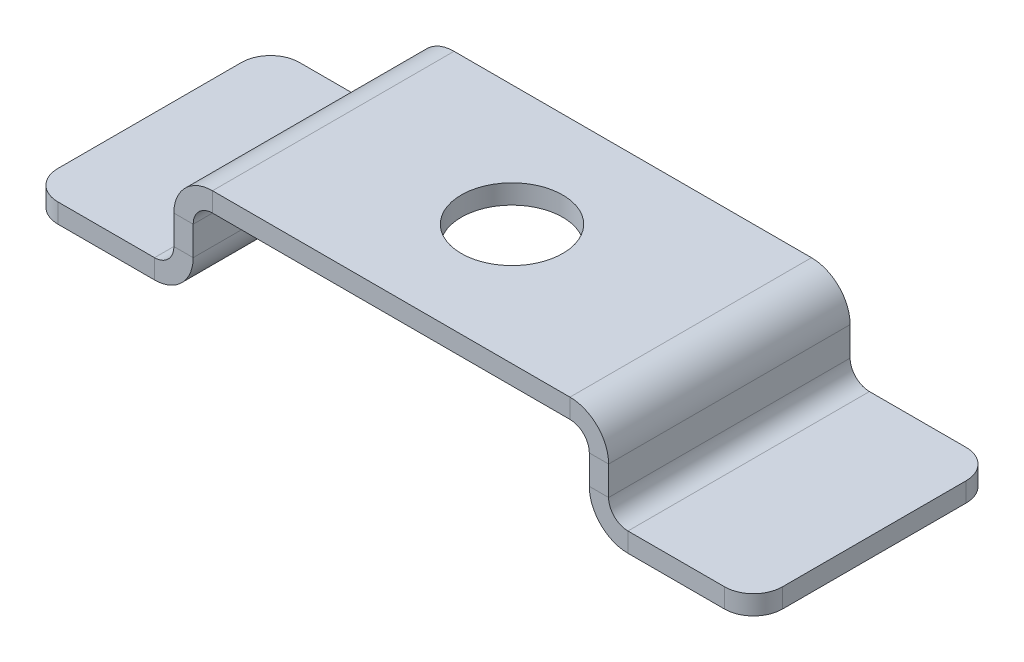
ISO-10303-21;
HEADER;
FILE_DESCRIPTION(('STEP AP214'),'2;1');
FILE_NAME('part.step','',(''),(''),'','','');
FILE_SCHEMA(('AUTOMOTIVE_DESIGN { 1 0 10303 214 1 1 1 1 }'));
ENDSEC;
DATA;
#1=APPLICATION_CONTEXT('core data for automotive mechanical design processes');
#2=APPLICATION_PROTOCOL_DEFINITION('international standard','automotive_design',2000,#1);
#3=PRODUCT_CONTEXT('',#1,'mechanical');
#4=PRODUCT('Part','Part','',(#3));
#5=PRODUCT_RELATED_PRODUCT_CATEGORY('part','',(#4));
#6=PRODUCT_DEFINITION_FORMATION('','',#4);
#7=PRODUCT_DEFINITION_CONTEXT('part definition',#1,'design');
#8=PRODUCT_DEFINITION('design','',#6,#7);
#9=PRODUCT_DEFINITION_SHAPE('','',#8);
#10=(LENGTH_UNIT() NAMED_UNIT(*) SI_UNIT(.MILLI.,.METRE.));
#11=(NAMED_UNIT(*) PLANE_ANGLE_UNIT() SI_UNIT($,.RADIAN.));
#12=(NAMED_UNIT(*) SI_UNIT($,.STERADIAN.) SOLID_ANGLE_UNIT());
#13=UNCERTAINTY_MEASURE_WITH_UNIT(LENGTH_MEASURE(1.E-05),#10,'distance_accuracy_value','');
#14=(GEOMETRIC_REPRESENTATION_CONTEXT(3) GLOBAL_UNCERTAINTY_ASSIGNED_CONTEXT((#13)) GLOBAL_UNIT_ASSIGNED_CONTEXT((#10,
#11,#12)) REPRESENTATION_CONTEXT('',''));
#15=CARTESIAN_POINT('',(0.,0.,0.));
#16=DIRECTION('',(0.,0.,1.));
#17=DIRECTION('',(1.,0.,0.));
#18=AXIS2_PLACEMENT_3D('',#15,#16,#17);
#19=CARTESIAN_POINT('',(-22.5,2.,25.));
#20=DIRECTION('',(0.,0.,1.));
#21=DIRECTION('',(1.,0.,0.));
#22=AXIS2_PLACEMENT_3D('',#19,#20,#21);
#23=PLANE('',#22);
#24=DIRECTION('',(1.,0.,0.));
#25=VECTOR('',#24,1.);
#26=CARTESIAN_POINT('',(-22.5,2.,25.));
#27=LINE('',#26,#25);
#28=CARTESIAN_POINT('',(-22.5,2.,25.));
#29=VERTEX_POINT('',#28);
#30=CARTESIAN_POINT('',(-20.5,2.,25.));
#31=VERTEX_POINT('',#30);
#32=EDGE_CURVE('E424',#29,#31,#27,.T.);
#33=ORIENTED_EDGE('',*,*,#32,.F.);
#34=CARTESIAN_POINT('',(-24.5,2.,25.));
#35=DIRECTION('',(0.,0.,-1.));
#36=DIRECTION('',(-1.,0.,0.));
#37=AXIS2_PLACEMENT_3D('',#34,#35,#36);
#38=CIRCLE('',#37,2.);
#39=CARTESIAN_POINT('',(-24.5,0.,25.));
#40=VERTEX_POINT('',#39);
#41=EDGE_CURVE('E267',#40,#29,#38,.F.);
#42=ORIENTED_EDGE('',*,*,#41,.F.);
#43=DIRECTION('',(0.,1.,0.));
#44=VECTOR('',#43,1.);
#45=CARTESIAN_POINT('',(-24.5,-2.,25.));
#46=LINE('',#45,#44);
#47=CARTESIAN_POINT('',(-24.5,-2.,25.));
#48=VERTEX_POINT('',#47);
#49=EDGE_CURVE('E421',#48,#40,#46,.T.);
#50=ORIENTED_EDGE('',*,*,#49,.F.);
#51=CARTESIAN_POINT('',(-24.5,2.,25.));
#52=DIRECTION('',(0.,0.,1.));
#53=DIRECTION('',(1.,0.,0.));
#54=AXIS2_PLACEMENT_3D('',#51,#52,#53);
#55=CIRCLE('',#54,4.);
#56=EDGE_CURVE('E274',#48,#31,#55,.T.);
#57=ORIENTED_EDGE('',*,*,#56,.T.);
#58=EDGE_LOOP('',(#33,#42,#50,#57));
#59=FACE_BOUND('',#58,.T.);
#60=ADVANCED_FACE('F48',(#59),#23,.T.);
#61=CARTESIAN_POINT('',(-24.5,-2.,25.));
#62=DIRECTION('',(0.,0.,1.));
#63=DIRECTION('',(1.,0.,0.));
#64=AXIS2_PLACEMENT_3D('',#61,#62,#63);
#65=PLANE('',#64);
#66=DIRECTION('',(0.,1.,0.));
#67=VECTOR('',#66,1.);
#68=CARTESIAN_POINT('',(-22.5,0.,25.));
#69=LINE('',#68,#67);
#70=CARTESIAN_POINT('',(-22.5,5.,25.));
#71=VERTEX_POINT('',#70);
#72=EDGE_CURVE('E264',#29,#71,#69,.T.);
#73=ORIENTED_EDGE('',*,*,#72,.F.);
#74=ORIENTED_EDGE('',*,*,#32,.T.);
#75=DIRECTION('',(0.,1.,0.));
#76=VECTOR('',#75,1.);
#77=CARTESIAN_POINT('',(-20.5,0.,25.));
#78=LINE('',#77,#76);
#79=CARTESIAN_POINT('',(-20.5,5.,25.));
#80=VERTEX_POINT('',#79);
#81=EDGE_CURVE('E277',#31,#80,#78,.T.);
#82=ORIENTED_EDGE('',*,*,#81,.T.);
#83=DIRECTION('',(-1.,0.,0.));
#84=VECTOR('',#83,1.);
#85=CARTESIAN_POINT('',(-20.5,5.,25.));
#86=LINE('',#85,#84);
#87=EDGE_CURVE('E412',#80,#71,#86,.T.);
#88=ORIENTED_EDGE('',*,*,#87,.T.);
#89=EDGE_LOOP('',(#73,#74,#82,#88));
#90=FACE_BOUND('',#89,.T.);
#91=ADVANCED_FACE('F483',(#90),#65,.T.);
#92=CARTESIAN_POINT('',(-24.5,0.,0.));
#93=DIRECTION('',(0.,0.,-1.));
#94=DIRECTION('',(-1.,0.,0.));
#95=AXIS2_PLACEMENT_3D('',#92,#93,#94);
#96=PLANE('',#95);
#97=DIRECTION('',(0.,-1.,0.));
#98=VECTOR('',#97,1.);
#99=CARTESIAN_POINT('',(-24.5,0.,0.));
#100=LINE('',#99,#98);
#101=CARTESIAN_POINT('',(-24.5,0.,0.));
#102=VERTEX_POINT('',#101);
#103=CARTESIAN_POINT('',(-24.5,-2.,0.));
#104=VERTEX_POINT('',#103);
#105=EDGE_CURVE('E418',#102,#104,#100,.T.);
#106=ORIENTED_EDGE('',*,*,#105,.F.);
#107=CARTESIAN_POINT('',(-24.5,2.,0.));
#108=DIRECTION('',(0.,0.,-1.));
#109=DIRECTION('',(-1.,0.,0.));
#110=AXIS2_PLACEMENT_3D('',#107,#108,#109);
#111=CIRCLE('',#110,2.);
#112=CARTESIAN_POINT('',(-22.5,2.,0.));
#113=VERTEX_POINT('',#112);
#114=EDGE_CURVE('E316',#102,#113,#111,.F.);
#115=ORIENTED_EDGE('',*,*,#114,.T.);
#116=DIRECTION('',(-1.,0.,0.));
#117=VECTOR('',#116,1.);
#118=CARTESIAN_POINT('',(-20.5,2.,0.));
#119=LINE('',#118,#117);
#120=CARTESIAN_POINT('',(-20.5,2.,0.));
#121=VERTEX_POINT('',#120);
#122=EDGE_CURVE('E416',#121,#113,#119,.T.);
#123=ORIENTED_EDGE('',*,*,#122,.F.);
#124=CARTESIAN_POINT('',(-24.5,2.,0.));
#125=DIRECTION('',(0.,0.,1.));
#126=DIRECTION('',(1.,0.,0.));
#127=AXIS2_PLACEMENT_3D('',#124,#125,#126);
#128=CIRCLE('',#127,4.);
#129=EDGE_CURVE('E323',#104,#121,#128,.T.);
#130=ORIENTED_EDGE('',*,*,#129,.F.);
#131=EDGE_LOOP('',(#106,#115,#123,#130));
#132=FACE_BOUND('',#131,.T.);
#133=ADVANCED_FACE('F564',(#132),#96,.T.);
#134=CARTESIAN_POINT('',(-20.5,2.,0.));
#135=DIRECTION('',(0.,0.,-1.));
#136=DIRECTION('',(-1.,0.,0.));
#137=AXIS2_PLACEMENT_3D('',#134,#135,#136);
#138=PLANE('',#137);
#139=DIRECTION('',(1.,0.,0.));
#140=VECTOR('',#139,1.);
#141=CARTESIAN_POINT('',(-37.5,-2.,0.));
#142=LINE('',#141,#140);
#143=CARTESIAN_POINT('',(-34.5,-2.,0.));
#144=VERTEX_POINT('',#143);
#145=EDGE_CURVE('E321',#144,#104,#142,.T.);
#146=ORIENTED_EDGE('',*,*,#145,.F.);
#147=DIRECTION('',(0.,1.,0.));
#148=VECTOR('',#147,1.);
#149=CARTESIAN_POINT('',(-34.5,2.,0.));
#150=LINE('',#149,#148);
#151=CARTESIAN_POINT('',(-34.5,0.,0.));
#152=VERTEX_POINT('',#151);
#153=EDGE_CURVE('E11',#144,#152,#150,.T.);
#154=ORIENTED_EDGE('',*,*,#153,.T.);
#155=DIRECTION('',(1.,0.,0.));
#156=VECTOR('',#155,1.);
#157=CARTESIAN_POINT('',(-37.5,0.,0.));
#158=LINE('',#157,#156);
#159=EDGE_CURVE('E319',#152,#102,#158,.T.);
#160=ORIENTED_EDGE('',*,*,#159,.T.);
#161=ORIENTED_EDGE('',*,*,#105,.T.);
#162=EDGE_LOOP('',(#146,#154,#160,#161));
#163=FACE_BOUND('',#162,.T.);
#164=ADVANCED_FACE('F583',(#163),#138,.T.);
#165=CARTESIAN_POINT('',(-18.5,9.00000000000001,25.));
#166=DIRECTION('',(0.,0.,1.));
#167=DIRECTION('',(1.,0.,0.));
#168=AXIS2_PLACEMENT_3D('',#165,#166,#167);
#169=PLANE('',#168);
#170=DIRECTION('',(0.,-1.,0.));
#171=VECTOR('',#170,1.);
#172=CARTESIAN_POINT('',(-18.5,9.00000000000001,25.));
#173=LINE('',#172,#171);
#174=CARTESIAN_POINT('',(-18.5,9.00000000000001,25.));
#175=VERTEX_POINT('',#174);
#176=CARTESIAN_POINT('',(-18.5,7.00000000000001,25.));
#177=VERTEX_POINT('',#176);
#178=EDGE_CURVE('E414',#175,#177,#173,.T.);
#179=ORIENTED_EDGE('',*,*,#178,.F.);
#180=CARTESIAN_POINT('',(-18.5,5.,25.));
#181=DIRECTION('',(0.,0.,1.));
#182=DIRECTION('',(1.,0.,0.));
#183=AXIS2_PLACEMENT_3D('',#180,#181,#182);
#184=CIRCLE('',#183,4.);
#185=EDGE_CURVE('E261',#71,#175,#184,.F.);
#186=ORIENTED_EDGE('',*,*,#185,.F.);
#187=ORIENTED_EDGE('',*,*,#87,.F.);
#188=CARTESIAN_POINT('',(-18.5,5.,25.));
#189=DIRECTION('',(0.,0.,1.));
#190=DIRECTION('',(1.,0.,0.));
#191=AXIS2_PLACEMENT_3D('',#188,#189,#190);
#192=CIRCLE('',#191,2.);
#193=EDGE_CURVE('E280',#80,#177,#192,.F.);
#194=ORIENTED_EDGE('',*,*,#193,.T.);
#195=EDGE_LOOP('',(#179,#186,#187,#194));
#196=FACE_BOUND('',#195,.T.);
#197=ADVANCED_FACE('F492',(#196),#169,.T.);
#198=CARTESIAN_POINT('',(-20.5,5.,25.));
#199=DIRECTION('',(0.,0.,1.));
#200=DIRECTION('',(1.,0.,0.));
#201=AXIS2_PLACEMENT_3D('',#198,#199,#200);
#202=PLANE('',#201);
#203=DIRECTION('',(1.,0.,0.));
#204=VECTOR('',#203,1.);
#205=CARTESIAN_POINT('',(-22.5,9.00000000000001,25.));
#206=LINE('',#205,#204);
#207=CARTESIAN_POINT('',(18.5,9.00000000000001,25.));
#208=VERTEX_POINT('',#207);
#209=EDGE_CURVE('E258',#175,#208,#206,.T.);
#210=ORIENTED_EDGE('',*,*,#209,.F.);
#211=ORIENTED_EDGE('',*,*,#178,.T.);
#212=DIRECTION('',(1.,0.,0.));
#213=VECTOR('',#212,1.);
#214=CARTESIAN_POINT('',(-22.5,7.00000000000001,25.));
#215=LINE('',#214,#213);
#216=CARTESIAN_POINT('',(18.5,7.00000000000001,25.));
#217=VERTEX_POINT('',#216);
#218=EDGE_CURVE('E283',#177,#217,#215,.T.);
#219=ORIENTED_EDGE('',*,*,#218,.T.);
#220=DIRECTION('',(0.,1.,0.));
#221=VECTOR('',#220,1.);
#222=CARTESIAN_POINT('',(18.5,7.00000000000001,25.));
#223=LINE('',#222,#221);
#224=EDGE_CURVE('E404',#217,#208,#223,.T.);
#225=ORIENTED_EDGE('',*,*,#224,.T.);
#226=EDGE_LOOP('',(#210,#211,#219,#225));
#227=FACE_BOUND('',#226,.T.);
#228=ADVANCED_FACE('F501',(#227),#202,.T.);
#229=CARTESIAN_POINT('',(-22.5,5.,0.));
#230=DIRECTION('',(0.,0.,-1.));
#231=DIRECTION('',(-1.,0.,0.));
#232=AXIS2_PLACEMENT_3D('',#229,#230,#231);
#233=PLANE('',#232);
#234=DIRECTION('',(1.,0.,0.));
#235=VECTOR('',#234,1.);
#236=CARTESIAN_POINT('',(-22.5,5.,0.));
#237=LINE('',#236,#235);
#238=CARTESIAN_POINT('',(-22.5,5.,0.));
#239=VERTEX_POINT('',#238);
#240=CARTESIAN_POINT('',(-20.5,5.,0.));
#241=VERTEX_POINT('',#240);
#242=EDGE_CURVE('E410',#239,#241,#237,.T.);
#243=ORIENTED_EDGE('',*,*,#242,.F.);
#244=CARTESIAN_POINT('',(-18.5,5.,0.));
#245=DIRECTION('',(0.,0.,1.));
#246=DIRECTION('',(1.,0.,0.));
#247=AXIS2_PLACEMENT_3D('',#244,#245,#246);
#248=CIRCLE('',#247,4.);
#249=CARTESIAN_POINT('',(-18.5,9.00000000000001,0.));
#250=VERTEX_POINT('',#249);
#251=EDGE_CURVE('E310',#239,#250,#248,.F.);
#252=ORIENTED_EDGE('',*,*,#251,.T.);
#253=DIRECTION('',(0.,1.,0.));
#254=VECTOR('',#253,1.);
#255=CARTESIAN_POINT('',(-18.5,7.00000000000001,0.));
#256=LINE('',#255,#254);
#257=CARTESIAN_POINT('',(-18.5,7.00000000000001,0.));
#258=VERTEX_POINT('',#257);
#259=EDGE_CURVE('E408',#258,#250,#256,.T.);
#260=ORIENTED_EDGE('',*,*,#259,.F.);
#261=CARTESIAN_POINT('',(-18.5,5.,0.));
#262=DIRECTION('',(0.,0.,1.));
#263=DIRECTION('',(1.,0.,0.));
#264=AXIS2_PLACEMENT_3D('',#261,#262,#263);
#265=CIRCLE('',#264,2.);
#266=EDGE_CURVE('E329',#241,#258,#265,.F.);
#267=ORIENTED_EDGE('',*,*,#266,.F.);
#268=EDGE_LOOP('',(#243,#252,#260,#267));
#269=FACE_BOUND('',#268,.T.);
#270=ADVANCED_FACE('F643',(#269),#233,.T.);
#271=CARTESIAN_POINT('',(-18.5,7.00000000000001,0.));
#272=DIRECTION('',(0.,0.,-1.));
#273=DIRECTION('',(-1.,0.,0.));
#274=AXIS2_PLACEMENT_3D('',#271,#272,#273);
#275=PLANE('',#274);
#276=DIRECTION('',(0.,1.,0.));
#277=VECTOR('',#276,1.);
#278=CARTESIAN_POINT('',(-22.5,0.,0.));
#279=LINE('',#278,#277);
#280=EDGE_CURVE('E313',#113,#239,#279,.T.);
#281=ORIENTED_EDGE('',*,*,#280,.T.);
#282=ORIENTED_EDGE('',*,*,#242,.T.);
#283=DIRECTION('',(0.,1.,0.));
#284=VECTOR('',#283,1.);
#285=CARTESIAN_POINT('',(-20.5,0.,0.));
#286=LINE('',#285,#284);
#287=EDGE_CURVE('E326',#121,#241,#286,.T.);
#288=ORIENTED_EDGE('',*,*,#287,.F.);
#289=ORIENTED_EDGE('',*,*,#122,.T.);
#290=EDGE_LOOP('',(#281,#282,#288,#289));
#291=FACE_BOUND('',#290,.T.);
#292=ADVANCED_FACE('F640',(#291),#275,.T.);
#293=CARTESIAN_POINT('',(22.5,5.,25.));
#294=DIRECTION('',(0.,0.,1.));
#295=DIRECTION('',(1.,0.,0.));
#296=AXIS2_PLACEMENT_3D('',#293,#294,#295);
#297=PLANE('',#296);
#298=DIRECTION('',(-1.,0.,0.));
#299=VECTOR('',#298,1.);
#300=CARTESIAN_POINT('',(22.5,5.,25.));
#301=LINE('',#300,#299);
#302=CARTESIAN_POINT('',(22.5,5.,25.));
#303=VERTEX_POINT('',#302);
#304=CARTESIAN_POINT('',(20.5,5.,25.));
#305=VERTEX_POINT('',#304);
#306=EDGE_CURVE('E406',#303,#305,#301,.T.);
#307=ORIENTED_EDGE('',*,*,#306,.F.);
#308=CARTESIAN_POINT('',(18.5,5.,25.));
#309=DIRECTION('',(0.,0.,1.));
#310=DIRECTION('',(1.,0.,0.));
#311=AXIS2_PLACEMENT_3D('',#308,#309,#310);
#312=CIRCLE('',#311,4.);
#313=EDGE_CURVE('E252',#208,#303,#312,.F.);
#314=ORIENTED_EDGE('',*,*,#313,.F.);
#315=ORIENTED_EDGE('',*,*,#224,.F.);
#316=CARTESIAN_POINT('',(18.5,5.,25.));
#317=DIRECTION('',(0.,0.,1.));
#318=DIRECTION('',(1.,0.,0.));
#319=AXIS2_PLACEMENT_3D('',#316,#317,#318);
#320=CIRCLE('',#319,2.);
#321=EDGE_CURVE('E286',#217,#305,#320,.F.);
#322=ORIENTED_EDGE('',*,*,#321,.T.);
#323=EDGE_LOOP('',(#307,#314,#315,#322));
#324=FACE_BOUND('',#323,.T.);
#325=ADVANCED_FACE('F510',(#324),#297,.T.);
#326=CARTESIAN_POINT('',(18.5,7.00000000000001,25.));
#327=DIRECTION('',(0.,0.,1.));
#328=DIRECTION('',(1.,0.,0.));
#329=AXIS2_PLACEMENT_3D('',#326,#327,#328);
#330=PLANE('',#329);
#331=DIRECTION('',(0.,-1.,0.));
#332=VECTOR('',#331,1.);
#333=CARTESIAN_POINT('',(22.5,9.00000000000001,25.));
#334=LINE('',#333,#332);
#335=CARTESIAN_POINT('',(22.5,2.,25.));
#336=VERTEX_POINT('',#335);
#337=EDGE_CURVE('E250',#303,#336,#334,.T.);
#338=ORIENTED_EDGE('',*,*,#337,.F.);
#339=ORIENTED_EDGE('',*,*,#306,.T.);
#340=DIRECTION('',(0.,1.,0.));
#341=VECTOR('',#340,1.);
#342=CARTESIAN_POINT('',(20.5,9.00000000000001,25.));
#343=LINE('',#342,#341);
#344=CARTESIAN_POINT('',(20.5,2.,25.));
#345=VERTEX_POINT('',#344);
#346=EDGE_CURVE('E289',#305,#345,#343,.F.);
#347=ORIENTED_EDGE('',*,*,#346,.T.);
#348=DIRECTION('',(1.,0.,0.));
#349=VECTOR('',#348,1.);
#350=CARTESIAN_POINT('',(20.5,2.,25.));
#351=LINE('',#350,#349);
#352=EDGE_CURVE('E224',#345,#336,#351,.T.);
#353=ORIENTED_EDGE('',*,*,#352,.T.);
#354=EDGE_LOOP('',(#338,#339,#347,#353));
#355=FACE_BOUND('',#354,.T.);
#356=ADVANCED_FACE('F519',(#355),#330,.T.);
#357=CARTESIAN_POINT('',(18.5,9.00000000000001,0.));
#358=DIRECTION('',(0.,0.,-1.));
#359=DIRECTION('',(-1.,0.,0.));
#360=AXIS2_PLACEMENT_3D('',#357,#358,#359);
#361=PLANE('',#360);
#362=DIRECTION('',(0.,-1.,0.));
#363=VECTOR('',#362,1.);
#364=CARTESIAN_POINT('',(18.5,9.00000000000001,0.));
#365=LINE('',#364,#363);
#366=CARTESIAN_POINT('',(18.5,9.00000000000001,0.));
#367=VERTEX_POINT('',#366);
#368=CARTESIAN_POINT('',(18.5,7.00000000000001,0.));
#369=VERTEX_POINT('',#368);
#370=EDGE_CURVE('E402',#367,#369,#365,.T.);
#371=ORIENTED_EDGE('',*,*,#370,.F.);
#372=CARTESIAN_POINT('',(18.5,5.,0.));
#373=DIRECTION('',(0.,0.,1.));
#374=DIRECTION('',(1.,0.,0.));
#375=AXIS2_PLACEMENT_3D('',#372,#373,#374);
#376=CIRCLE('',#375,4.);
#377=CARTESIAN_POINT('',(22.5,5.,0.));
#378=VERTEX_POINT('',#377);
#379=EDGE_CURVE('E304',#367,#378,#376,.F.);
#380=ORIENTED_EDGE('',*,*,#379,.T.);
#381=DIRECTION('',(1.,0.,0.));
#382=VECTOR('',#381,1.);
#383=CARTESIAN_POINT('',(20.5,5.,0.));
#384=LINE('',#383,#382);
#385=CARTESIAN_POINT('',(20.5,5.,0.));
#386=VERTEX_POINT('',#385);
#387=EDGE_CURVE('E223',#386,#378,#384,.T.);
#388=ORIENTED_EDGE('',*,*,#387,.F.);
#389=CARTESIAN_POINT('',(18.5,5.,0.));
#390=DIRECTION('',(0.,0.,1.));
#391=DIRECTION('',(1.,0.,0.));
#392=AXIS2_PLACEMENT_3D('',#389,#390,#391);
#393=CIRCLE('',#392,2.);
#394=EDGE_CURVE('E335',#369,#386,#393,.F.);
#395=ORIENTED_EDGE('',*,*,#394,.F.);
#396=EDGE_LOOP('',(#371,#380,#388,#395));
#397=FACE_BOUND('',#396,.T.);
#398=ADVANCED_FACE('F631',(#397),#361,.T.);
#399=CARTESIAN_POINT('',(20.5,5.,0.));
#400=DIRECTION('',(0.,0.,-1.));
#401=DIRECTION('',(-1.,0.,0.));
#402=AXIS2_PLACEMENT_3D('',#399,#400,#401);
#403=PLANE('',#402);
#404=DIRECTION('',(1.,0.,0.));
#405=VECTOR('',#404,1.);
#406=CARTESIAN_POINT('',(-22.5,9.00000000000001,0.));
#407=LINE('',#406,#405);
#408=EDGE_CURVE('E307',#250,#367,#407,.T.);
#409=ORIENTED_EDGE('',*,*,#408,.T.);
#410=ORIENTED_EDGE('',*,*,#370,.T.);
#411=DIRECTION('',(1.,0.,0.));
#412=VECTOR('',#411,1.);
#413=CARTESIAN_POINT('',(-22.5,7.00000000000001,0.));
#414=LINE('',#413,#412);
#415=EDGE_CURVE('E332',#258,#369,#414,.T.);
#416=ORIENTED_EDGE('',*,*,#415,.F.);
#417=ORIENTED_EDGE('',*,*,#259,.T.);
#418=EDGE_LOOP('',(#409,#410,#416,#417));
#419=FACE_BOUND('',#418,.T.);
#420=ADVANCED_FACE('F628',(#419),#403,.T.);
#421=CARTESIAN_POINT('',(24.5,0.,25.));
#422=DIRECTION('',(0.,0.,1.));
#423=DIRECTION('',(1.,0.,0.));
#424=AXIS2_PLACEMENT_3D('',#421,#422,#423);
#425=PLANE('',#424);
#426=DIRECTION('',(0.,-1.,0.));
#427=VECTOR('',#426,1.);
#428=CARTESIAN_POINT('',(24.5,0.,25.));
#429=LINE('',#428,#427);
#430=CARTESIAN_POINT('',(24.5,0.,25.));
#431=VERTEX_POINT('',#430);
#432=CARTESIAN_POINT('',(24.5,-2.,25.));
#433=VERTEX_POINT('',#432);
#434=EDGE_CURVE('E211',#431,#433,#429,.T.);
#435=ORIENTED_EDGE('',*,*,#434,.F.);
#436=CARTESIAN_POINT('',(24.5,2.,25.));
#437=DIRECTION('',(0.,0.,-1.));
#438=DIRECTION('',(-1.,0.,0.));
#439=AXIS2_PLACEMENT_3D('',#436,#437,#438);
#440=CIRCLE('',#439,2.);
#441=EDGE_CURVE('E215',#336,#431,#440,.F.);
#442=ORIENTED_EDGE('',*,*,#441,.F.);
#443=ORIENTED_EDGE('',*,*,#352,.F.);
#444=CARTESIAN_POINT('',(24.5,2.,25.));
#445=DIRECTION('',(0.,0.,1.));
#446=DIRECTION('',(1.,0.,0.));
#447=AXIS2_PLACEMENT_3D('',#444,#445,#446);
#448=CIRCLE('',#447,4.);
#449=EDGE_CURVE('E218',#345,#433,#448,.T.);
#450=ORIENTED_EDGE('',*,*,#449,.T.);
#451=EDGE_LOOP('',(#435,#442,#443,#450));
#452=FACE_BOUND('',#451,.T.);
#453=ADVANCED_FACE('F213',(#452),#425,.T.);
#454=CARTESIAN_POINT('',(20.5,2.,25.));
#455=DIRECTION('',(0.,0.,1.));
#456=DIRECTION('',(1.,0.,0.));
#457=AXIS2_PLACEMENT_3D('',#454,#455,#456);
#458=PLANE('',#457);
#459=DIRECTION('',(1.,0.,0.));
#460=VECTOR('',#459,1.);
#461=CARTESIAN_POINT('',(22.5,-2.,25.));
#462=LINE('',#461,#460);
#463=CARTESIAN_POINT('',(34.5,-2.,25.));
#464=VERTEX_POINT('',#463);
#465=EDGE_CURVE('E245',#433,#464,#462,.T.);
#466=ORIENTED_EDGE('',*,*,#465,.T.);
#467=DIRECTION('',(0.,-1.,0.));
#468=VECTOR('',#467,1.);
#469=CARTESIAN_POINT('',(34.5,2.,25.));
#470=LINE('',#469,#468);
#471=CARTESIAN_POINT('',(34.5,0.,25.));
#472=VERTEX_POINT('',#471);
#473=EDGE_CURVE('E244',#464,#472,#470,.F.);
#474=ORIENTED_EDGE('',*,*,#473,.T.);
#475=DIRECTION('',(1.,0.,0.));
#476=VECTOR('',#475,1.);
#477=CARTESIAN_POINT('',(22.5,0.,25.));
#478=LINE('',#477,#476);
#479=EDGE_CURVE('E232',#431,#472,#478,.T.);
#480=ORIENTED_EDGE('',*,*,#479,.F.);
#481=ORIENTED_EDGE('',*,*,#434,.T.);
#482=EDGE_LOOP('',(#466,#474,#480,#481));
#483=FACE_BOUND('',#482,.T.);
#484=ADVANCED_FACE('F242',(#483),#458,.T.);
#485=CARTESIAN_POINT('',(22.5,2.,0.));
#486=DIRECTION('',(0.,0.,-1.));
#487=DIRECTION('',(-1.,0.,0.));
#488=AXIS2_PLACEMENT_3D('',#485,#486,#487);
#489=PLANE('',#488);
#490=DIRECTION('',(-1.,0.,0.));
#491=VECTOR('',#490,1.);
#492=CARTESIAN_POINT('',(22.5,2.,0.));
#493=LINE('',#492,#491);
#494=CARTESIAN_POINT('',(22.5,2.,0.));
#495=VERTEX_POINT('',#494);
#496=CARTESIAN_POINT('',(20.5,2.,0.));
#497=VERTEX_POINT('',#496);
#498=EDGE_CURVE('E398',#495,#497,#493,.T.);
#499=ORIENTED_EDGE('',*,*,#498,.F.);
#500=CARTESIAN_POINT('',(24.5,2.,0.));
#501=DIRECTION('',(0.,0.,-1.));
#502=DIRECTION('',(-1.,0.,0.));
#503=AXIS2_PLACEMENT_3D('',#500,#501,#502);
#504=CIRCLE('',#503,2.);
#505=CARTESIAN_POINT('',(24.5,0.,0.));
#506=VERTEX_POINT('',#505);
#507=EDGE_CURVE('E299',#495,#506,#504,.F.);
#508=ORIENTED_EDGE('',*,*,#507,.T.);
#509=DIRECTION('',(0.,1.,0.));
#510=VECTOR('',#509,1.);
#511=CARTESIAN_POINT('',(24.5,-2.,0.));
#512=LINE('',#511,#510);
#513=CARTESIAN_POINT('',(24.5,-2.,0.));
#514=VERTEX_POINT('',#513);
#515=EDGE_CURVE('E396',#514,#506,#512,.T.);
#516=ORIENTED_EDGE('',*,*,#515,.F.);
#517=CARTESIAN_POINT('',(24.5,2.,0.));
#518=DIRECTION('',(0.,0.,1.));
#519=DIRECTION('',(1.,0.,0.));
#520=AXIS2_PLACEMENT_3D('',#517,#518,#519);
#521=CIRCLE('',#520,4.);
#522=EDGE_CURVE('E341',#497,#514,#521,.T.);
#523=ORIENTED_EDGE('',*,*,#522,.F.);
#524=EDGE_LOOP('',(#499,#508,#516,#523));
#525=FACE_BOUND('',#524,.T.);
#526=ADVANCED_FACE('F601',(#525),#489,.T.);
#527=CARTESIAN_POINT('',(24.5,-2.,0.));
#528=DIRECTION('',(0.,0.,-1.));
#529=DIRECTION('',(-1.,0.,0.));
#530=AXIS2_PLACEMENT_3D('',#527,#528,#529);
#531=PLANE('',#530);
#532=DIRECTION('',(0.,-1.,0.));
#533=VECTOR('',#532,1.);
#534=CARTESIAN_POINT('',(22.5,9.00000000000001,0.));
#535=LINE('',#534,#533);
#536=EDGE_CURVE('E301',#378,#495,#535,.T.);
#537=ORIENTED_EDGE('',*,*,#536,.T.);
#538=ORIENTED_EDGE('',*,*,#498,.T.);
#539=DIRECTION('',(0.,1.,0.));
#540=VECTOR('',#539,1.);
#541=CARTESIAN_POINT('',(20.5,9.00000000000001,0.));
#542=LINE('',#541,#540);
#543=EDGE_CURVE('E338',#386,#497,#542,.F.);
#544=ORIENTED_EDGE('',*,*,#543,.F.);
#545=ORIENTED_EDGE('',*,*,#387,.T.);
#546=EDGE_LOOP('',(#537,#538,#544,#545));
#547=FACE_BOUND('',#546,.T.);
#548=ADVANCED_FACE('F599',(#547),#531,.T.);
#549=CARTESIAN_POINT('',(22.5,-2.,25.));
#550=DIRECTION('',(0.,1.,0.));
#551=DIRECTION('',(0.,0.,1.));
#552=AXIS2_PLACEMENT_3D('',#549,#550,#551);
#553=PLANE('',#552);
#554=DIRECTION('',(0.,0.,-1.));
#555=VECTOR('',#554,1.);
#556=CARTESIAN_POINT('',(37.5,-2.,25.));
#557=LINE('',#556,#555);
#558=CARTESIAN_POINT('',(37.5,-2.,22.));
#559=VERTEX_POINT('',#558);
#560=CARTESIAN_POINT('',(37.5,-2.,3.));
#561=VERTEX_POINT('',#560);
#562=EDGE_CURVE('E393',#559,#561,#557,.T.);
#563=ORIENTED_EDGE('',*,*,#562,.F.);
#564=CARTESIAN_POINT('',(34.5,-2.,22.));
#565=DIRECTION('',(0.,1.,0.));
#566=DIRECTION('',(0.,0.,1.));
#567=AXIS2_PLACEMENT_3D('',#564,#565,#566);
#568=CIRCLE('',#567,3.);
#569=EDGE_CURVE('E433',#559,#464,#568,.F.);
#570=ORIENTED_EDGE('',*,*,#569,.T.);
#571=ORIENTED_EDGE('',*,*,#465,.F.);
#572=DIRECTION('',(0.,0.,-1.));
#573=VECTOR('',#572,1.);
#574=CARTESIAN_POINT('',(24.5,-2.,25.));
#575=LINE('',#574,#573);
#576=EDGE_CURVE('E293',#433,#514,#575,.T.);
#577=ORIENTED_EDGE('',*,*,#576,.T.);
#578=DIRECTION('',(1.,0.,0.));
#579=VECTOR('',#578,1.);
#580=CARTESIAN_POINT('',(22.5,-2.,0.));
#581=LINE('',#580,#579);
#582=CARTESIAN_POINT('',(34.5,-2.,0.));
#583=VERTEX_POINT('',#582);
#584=EDGE_CURVE('E294',#514,#583,#581,.T.);
#585=ORIENTED_EDGE('',*,*,#584,.T.);
#586=CARTESIAN_POINT('',(34.5,-2.,3.));
#587=DIRECTION('',(0.,1.,0.));
#588=DIRECTION('',(0.,0.,1.));
#589=AXIS2_PLACEMENT_3D('',#586,#587,#588);
#590=CIRCLE('',#589,3.);
#591=EDGE_CURVE('E431',#583,#561,#590,.F.);
#592=ORIENTED_EDGE('',*,*,#591,.T.);
#593=EDGE_LOOP('',(#563,#570,#571,#577,#585,#592));
#594=FACE_BOUND('',#593,.T.);
#595=ADVANCED_FACE('F532',(#594),#553,.F.);
#596=CARTESIAN_POINT('',(37.5,0.,25.));
#597=DIRECTION('',(1.,0.,0.));
#598=DIRECTION('',(0.,0.,-1.));
#599=AXIS2_PLACEMENT_3D('',#596,#597,#598);
#600=PLANE('',#599);
#601=DIRECTION('',(0.,0.,-1.));
#602=VECTOR('',#601,1.);
#603=CARTESIAN_POINT('',(37.5,0.,25.));
#604=LINE('',#603,#602);
#605=CARTESIAN_POINT('',(37.5,0.,22.));
#606=VERTEX_POINT('',#605);
#607=CARTESIAN_POINT('',(37.5,0.,3.));
#608=VERTEX_POINT('',#607);
#609=EDGE_CURVE('E239',#606,#608,#604,.T.);
#610=ORIENTED_EDGE('',*,*,#609,.F.);
#611=DIRECTION('',(0.,-1.,0.));
#612=VECTOR('',#611,1.);
#613=CARTESIAN_POINT('',(37.5,0.,22.));
#614=LINE('',#613,#612);
#615=EDGE_CURVE('E428',#606,#559,#614,.T.);
#616=ORIENTED_EDGE('',*,*,#615,.T.);
#617=ORIENTED_EDGE('',*,*,#562,.T.);
#618=DIRECTION('',(0.,-1.,0.));
#619=VECTOR('',#618,1.);
#620=CARTESIAN_POINT('',(37.5,0.,3.));
#621=LINE('',#620,#619);
#622=EDGE_CURVE('E426',#561,#608,#621,.F.);
#623=ORIENTED_EDGE('',*,*,#622,.T.);
#624=EDGE_LOOP('',(#610,#616,#617,#623));
#625=FACE_BOUND('',#624,.T.);
#626=ADVANCED_FACE('F607',(#625),#600,.T.);
#627=CARTESIAN_POINT('',(22.5,0.,25.));
#628=DIRECTION('',(0.,1.,0.));
#629=DIRECTION('',(0.,0.,1.));
#630=AXIS2_PLACEMENT_3D('',#627,#628,#629);
#631=PLANE('',#630);
#632=ORIENTED_EDGE('',*,*,#479,.T.);
#633=CARTESIAN_POINT('',(34.5,0.,22.));
#634=DIRECTION('',(0.,1.,0.));
#635=DIRECTION('',(0.,0.,1.));
#636=AXIS2_PLACEMENT_3D('',#633,#634,#635);
#637=CIRCLE('',#636,3.);
#638=EDGE_CURVE('E438',#472,#606,#637,.T.);
#639=ORIENTED_EDGE('',*,*,#638,.T.);
#640=ORIENTED_EDGE('',*,*,#609,.T.);
#641=CARTESIAN_POINT('',(34.5,0.,3.));
#642=DIRECTION('',(0.,1.,0.));
#643=DIRECTION('',(0.,0.,1.));
#644=AXIS2_PLACEMENT_3D('',#641,#642,#643);
#645=CIRCLE('',#644,3.);
#646=CARTESIAN_POINT('',(34.5,0.,0.));
#647=VERTEX_POINT('',#646);
#648=EDGE_CURVE('E436',#608,#647,#645,.T.);
#649=ORIENTED_EDGE('',*,*,#648,.T.);
#650=DIRECTION('',(1.,0.,0.));
#651=VECTOR('',#650,1.);
#652=CARTESIAN_POINT('',(22.5,0.,0.));
#653=LINE('',#652,#651);
#654=EDGE_CURVE('E235',#506,#647,#653,.T.);
#655=ORIENTED_EDGE('',*,*,#654,.F.);
#656=DIRECTION('',(0.,0.,-1.));
#657=VECTOR('',#656,1.);
#658=CARTESIAN_POINT('',(24.5,0.,25.));
#659=LINE('',#658,#657);
#660=EDGE_CURVE('E230',#431,#506,#659,.T.);
#661=ORIENTED_EDGE('',*,*,#660,.F.);
#662=EDGE_LOOP('',(#632,#639,#640,#649,#655,#661));
#663=FACE_BOUND('',#662,.T.);
#664=ADVANCED_FACE('F231',(#663),#631,.T.);
#665=CARTESIAN_POINT('',(24.5,2.,25.));
#666=DIRECTION('',(0.,0.,-1.));
#667=DIRECTION('',(-1.,0.,0.));
#668=AXIS2_PLACEMENT_3D('',#665,#666,#667);
#669=CYLINDRICAL_SURFACE('',#668,2.);
#670=ORIENTED_EDGE('',*,*,#507,.F.);
#671=DIRECTION('',(0.,0.,-1.));
#672=VECTOR('',#671,1.);
#673=CARTESIAN_POINT('',(22.5,2.,25.));
#674=LINE('',#673,#672);
#675=EDGE_CURVE('E240',#336,#495,#674,.T.);
#676=ORIENTED_EDGE('',*,*,#675,.F.);
#677=ORIENTED_EDGE('',*,*,#441,.T.);
#678=ORIENTED_EDGE('',*,*,#660,.T.);
#679=EDGE_LOOP('',(#670,#676,#677,#678));
#680=FACE_BOUND('',#679,.T.);
#681=ADVANCED_FACE('F248',(#680),#669,.F.);
#682=CARTESIAN_POINT('',(22.5,9.00000000000001,25.));
#683=DIRECTION('',(1.,0.,0.));
#684=DIRECTION('',(0.,0.,-1.));
#685=AXIS2_PLACEMENT_3D('',#682,#683,#684);
#686=PLANE('',#685);
#687=ORIENTED_EDGE('',*,*,#536,.F.);
#688=DIRECTION('',(0.,0.,-1.));
#689=VECTOR('',#688,1.);
#690=CARTESIAN_POINT('',(22.5,5.,25.));
#691=LINE('',#690,#689);
#692=EDGE_CURVE('E387',#303,#378,#691,.T.);
#693=ORIENTED_EDGE('',*,*,#692,.F.);
#694=ORIENTED_EDGE('',*,*,#337,.T.);
#695=ORIENTED_EDGE('',*,*,#675,.T.);
#696=EDGE_LOOP('',(#687,#693,#694,#695));
#697=FACE_BOUND('',#696,.T.);
#698=ADVANCED_FACE('F518',(#697),#686,.T.);
#699=CARTESIAN_POINT('',(18.5,5.,25.));
#700=DIRECTION('',(0.,0.,-1.));
#701=DIRECTION('',(-1.,0.,0.));
#702=AXIS2_PLACEMENT_3D('',#699,#700,#701);
#703=CYLINDRICAL_SURFACE('',#702,4.);
#704=ORIENTED_EDGE('',*,*,#379,.F.);
#705=DIRECTION('',(0.,0.,-1.));
#706=VECTOR('',#705,1.);
#707=CARTESIAN_POINT('',(18.5,9.00000000000001,25.));
#708=LINE('',#707,#706);
#709=EDGE_CURVE('E384',#208,#367,#708,.T.);
#710=ORIENTED_EDGE('',*,*,#709,.F.);
#711=ORIENTED_EDGE('',*,*,#313,.T.);
#712=ORIENTED_EDGE('',*,*,#692,.T.);
#713=EDGE_LOOP('',(#704,#710,#711,#712));
#714=FACE_BOUND('',#713,.T.);
#715=ADVANCED_FACE('F509',(#714),#703,.T.);
#716=CARTESIAN_POINT('',(-22.5,9.00000000000001,25.));
#717=DIRECTION('',(0.,1.,0.));
#718=DIRECTION('',(0.,0.,1.));
#719=AXIS2_PLACEMENT_3D('',#716,#717,#718);
#720=PLANE('',#719);
#721=CARTESIAN_POINT('',(0.,9.00000000000001,12.5));
#722=DIRECTION('',(0.,1.,0.));
#723=DIRECTION('',(0.,0.,1.));
#724=AXIS2_PLACEMENT_3D('',#721,#722,#723);
#725=CIRCLE('',#724,5.25);
#726=CARTESIAN_POINT('',(0.,9.00000000000001,17.75));
#727=VERTEX_POINT('',#726);
#728=EDGE_CURVE('E534',#727,#727,#725,.T.);
#729=ORIENTED_EDGE('',*,*,#728,.F.);
#730=EDGE_LOOP('',(#729));
#731=FACE_BOUND('',#730,.T.);
#732=ORIENTED_EDGE('',*,*,#408,.F.);
#733=DIRECTION('',(0.,0.,-1.));
#734=VECTOR('',#733,1.);
#735=CARTESIAN_POINT('',(-18.5,9.00000000000001,25.));
#736=LINE('',#735,#734);
#737=EDGE_CURVE('E381',#175,#250,#736,.T.);
#738=ORIENTED_EDGE('',*,*,#737,.F.);
#739=ORIENTED_EDGE('',*,*,#209,.T.);
#740=ORIENTED_EDGE('',*,*,#709,.T.);
#741=EDGE_LOOP('',(#732,#738,#739,#740));
#742=FACE_BOUND('',#741,.T.);
#743=ADVANCED_FACE('F500',(#731,#742),#720,.T.);
#744=CARTESIAN_POINT('',(-18.5,5.,25.));
#745=DIRECTION('',(0.,0.,-1.));
#746=DIRECTION('',(-1.,0.,0.));
#747=AXIS2_PLACEMENT_3D('',#744,#745,#746);
#748=CYLINDRICAL_SURFACE('',#747,4.);
#749=ORIENTED_EDGE('',*,*,#251,.F.);
#750=DIRECTION('',(0.,0.,-1.));
#751=VECTOR('',#750,1.);
#752=CARTESIAN_POINT('',(-22.5,5.,25.));
#753=LINE('',#752,#751);
#754=EDGE_CURVE('E378',#71,#239,#753,.T.);
#755=ORIENTED_EDGE('',*,*,#754,.F.);
#756=ORIENTED_EDGE('',*,*,#185,.T.);
#757=ORIENTED_EDGE('',*,*,#737,.T.);
#758=EDGE_LOOP('',(#749,#755,#756,#757));
#759=FACE_BOUND('',#758,.T.);
#760=ADVANCED_FACE('F491',(#759),#748,.T.);
#761=CARTESIAN_POINT('',(-22.5,0.,25.));
#762=DIRECTION('',(-1.,0.,0.));
#763=DIRECTION('',(0.,0.,1.));
#764=AXIS2_PLACEMENT_3D('',#761,#762,#763);
#765=PLANE('',#764);
#766=ORIENTED_EDGE('',*,*,#280,.F.);
#767=DIRECTION('',(0.,0.,-1.));
#768=VECTOR('',#767,1.);
#769=CARTESIAN_POINT('',(-22.5,2.,25.));
#770=LINE('',#769,#768);
#771=EDGE_CURVE('E375',#29,#113,#770,.T.);
#772=ORIENTED_EDGE('',*,*,#771,.F.);
#773=ORIENTED_EDGE('',*,*,#72,.T.);
#774=ORIENTED_EDGE('',*,*,#754,.T.);
#775=EDGE_LOOP('',(#766,#772,#773,#774));
#776=FACE_BOUND('',#775,.T.);
#777=ADVANCED_FACE('F482',(#776),#765,.T.);
#778=CARTESIAN_POINT('',(-24.5,2.,25.));
#779=DIRECTION('',(0.,0.,-1.));
#780=DIRECTION('',(-1.,0.,0.));
#781=AXIS2_PLACEMENT_3D('',#778,#779,#780);
#782=CYLINDRICAL_SURFACE('',#781,2.);
#783=ORIENTED_EDGE('',*,*,#114,.F.);
#784=DIRECTION('',(0.,0.,-1.));
#785=VECTOR('',#784,1.);
#786=CARTESIAN_POINT('',(-24.5,0.,25.));
#787=LINE('',#786,#785);
#788=EDGE_CURVE('E372',#40,#102,#787,.T.);
#789=ORIENTED_EDGE('',*,*,#788,.F.);
#790=ORIENTED_EDGE('',*,*,#41,.T.);
#791=ORIENTED_EDGE('',*,*,#771,.T.);
#792=EDGE_LOOP('',(#783,#789,#790,#791));
#793=FACE_BOUND('',#792,.T.);
#794=ADVANCED_FACE('F473',(#793),#782,.F.);
#795=CARTESIAN_POINT('',(-37.5,0.,25.));
#796=DIRECTION('',(0.,1.,0.));
#797=DIRECTION('',(0.,0.,1.));
#798=AXIS2_PLACEMENT_3D('',#795,#796,#797);
#799=PLANE('',#798);
#800=DIRECTION('',(0.,0.,-1.));
#801=VECTOR('',#800,1.);
#802=CARTESIAN_POINT('',(-37.5,0.,25.));
#803=LINE('',#802,#801);
#804=CARTESIAN_POINT('',(-37.5,0.,22.));
#805=VERTEX_POINT('',#804);
#806=CARTESIAN_POINT('',(-37.5,0.,3.));
#807=VERTEX_POINT('',#806);
#808=EDGE_CURVE('E369',#805,#807,#803,.T.);
#809=ORIENTED_EDGE('',*,*,#808,.F.);
#810=CARTESIAN_POINT('',(-34.5,0.,22.));
#811=DIRECTION('',(0.,1.,0.));
#812=DIRECTION('',(0.,0.,1.));
#813=AXIS2_PLACEMENT_3D('',#810,#811,#812);
#814=CIRCLE('',#813,3.);
#815=CARTESIAN_POINT('',(-34.5,0.,25.));
#816=VERTEX_POINT('',#815);
#817=EDGE_CURVE('E450',#805,#816,#814,.T.);
#818=ORIENTED_EDGE('',*,*,#817,.T.);
#819=DIRECTION('',(1.,0.,0.));
#820=VECTOR('',#819,1.);
#821=CARTESIAN_POINT('',(-37.5,0.,25.));
#822=LINE('',#821,#820);
#823=EDGE_CURVE('E270',#816,#40,#822,.T.);
#824=ORIENTED_EDGE('',*,*,#823,.T.);
#825=ORIENTED_EDGE('',*,*,#788,.T.);
#826=ORIENTED_EDGE('',*,*,#159,.F.);
#827=CARTESIAN_POINT('',(-34.5,0.,3.));
#828=DIRECTION('',(0.,1.,0.));
#829=DIRECTION('',(0.,0.,1.));
#830=AXIS2_PLACEMENT_3D('',#827,#828,#829);
#831=CIRCLE('',#830,3.);
#832=EDGE_CURVE('E448',#152,#807,#831,.T.);
#833=ORIENTED_EDGE('',*,*,#832,.T.);
#834=EDGE_LOOP('',(#809,#818,#824,#825,#826,#833));
#835=FACE_BOUND('',#834,.T.);
#836=ADVANCED_FACE('F465',(#835),#799,.T.);
#837=CARTESIAN_POINT('',(-37.5,-2.,25.));
#838=DIRECTION('',(-1.,0.,0.));
#839=DIRECTION('',(0.,0.,1.));
#840=AXIS2_PLACEMENT_3D('',#837,#838,#839);
#841=PLANE('',#840);
#842=DIRECTION('',(0.,0.,-1.));
#843=VECTOR('',#842,1.);
#844=CARTESIAN_POINT('',(-37.5,-2.,25.));
#845=LINE('',#844,#843);
#846=CARTESIAN_POINT('',(-37.5,-2.,22.));
#847=VERTEX_POINT('',#846);
#848=CARTESIAN_POINT('',(-37.5,-2.,3.));
#849=VERTEX_POINT('',#848);
#850=EDGE_CURVE('E367',#847,#849,#845,.T.);
#851=ORIENTED_EDGE('',*,*,#850,.F.);
#852=DIRECTION('',(0.,1.,0.));
#853=VECTOR('',#852,1.);
#854=CARTESIAN_POINT('',(-37.5,0.,22.));
#855=LINE('',#854,#853);
#856=EDGE_CURVE('E445',#847,#805,#855,.T.);
#857=ORIENTED_EDGE('',*,*,#856,.T.);
#858=ORIENTED_EDGE('',*,*,#808,.T.);
#859=DIRECTION('',(0.,1.,0.));
#860=VECTOR('',#859,1.);
#861=CARTESIAN_POINT('',(-37.5,-2.,3.));
#862=LINE('',#861,#860);
#863=EDGE_CURVE('E443',#807,#849,#862,.F.);
#864=ORIENTED_EDGE('',*,*,#863,.T.);
#865=EDGE_LOOP('',(#851,#857,#858,#864));
#866=FACE_BOUND('',#865,.T.);
#867=ADVANCED_FACE('F460',(#866),#841,.T.);
#868=CARTESIAN_POINT('',(-37.5,-2.,25.));
#869=DIRECTION('',(0.,1.,0.));
#870=DIRECTION('',(0.,0.,1.));
#871=AXIS2_PLACEMENT_3D('',#868,#869,#870);
#872=PLANE('',#871);
#873=DIRECTION('',(1.,0.,0.));
#874=VECTOR('',#873,1.);
#875=CARTESIAN_POINT('',(-37.5,-2.,25.));
#876=LINE('',#875,#874);
#877=CARTESIAN_POINT('',(-34.5,-2.,25.));
#878=VERTEX_POINT('',#877);
#879=EDGE_CURVE('E272',#878,#48,#876,.T.);
#880=ORIENTED_EDGE('',*,*,#879,.F.);
#881=CARTESIAN_POINT('',(-34.5,-2.,22.));
#882=DIRECTION('',(0.,1.,0.));
#883=DIRECTION('',(0.,0.,1.));
#884=AXIS2_PLACEMENT_3D('',#881,#882,#883);
#885=CIRCLE('',#884,3.);
#886=EDGE_CURVE('E56',#878,#847,#885,.F.);
#887=ORIENTED_EDGE('',*,*,#886,.T.);
#888=ORIENTED_EDGE('',*,*,#850,.T.);
#889=CARTESIAN_POINT('',(-34.5,-2.,3.));
#890=DIRECTION('',(0.,1.,0.));
#891=DIRECTION('',(0.,0.,1.));
#892=AXIS2_PLACEMENT_3D('',#889,#890,#891);
#893=CIRCLE('',#892,3.);
#894=EDGE_CURVE('E63',#849,#144,#893,.F.);
#895=ORIENTED_EDGE('',*,*,#894,.T.);
#896=ORIENTED_EDGE('',*,*,#145,.T.);
#897=DIRECTION('',(0.,0.,-1.));
#898=VECTOR('',#897,1.);
#899=CARTESIAN_POINT('',(-24.5,-2.,25.));
#900=LINE('',#899,#898);
#901=EDGE_CURVE('E364',#48,#104,#900,.T.);
#902=ORIENTED_EDGE('',*,*,#901,.F.);
#903=EDGE_LOOP('',(#880,#887,#888,#895,#896,#902));
#904=FACE_BOUND('',#903,.T.);
#905=ADVANCED_FACE('F455',(#904),#872,.F.);
#906=CARTESIAN_POINT('',(-24.5,2.,25.));
#907=DIRECTION('',(0.,0.,-1.));
#908=DIRECTION('',(-1.,0.,0.));
#909=AXIS2_PLACEMENT_3D('',#906,#907,#908);
#910=CYLINDRICAL_SURFACE('',#909,4.);
#911=ORIENTED_EDGE('',*,*,#129,.T.);
#912=DIRECTION('',(0.,0.,-1.));
#913=VECTOR('',#912,1.);
#914=CARTESIAN_POINT('',(-20.5,2.,25.));
#915=LINE('',#914,#913);
#916=EDGE_CURVE('E361',#31,#121,#915,.T.);
#917=ORIENTED_EDGE('',*,*,#916,.F.);
#918=ORIENTED_EDGE('',*,*,#56,.F.);
#919=ORIENTED_EDGE('',*,*,#901,.T.);
#920=EDGE_LOOP('',(#911,#917,#918,#919));
#921=FACE_BOUND('',#920,.T.);
#922=ADVANCED_FACE('F587',(#921),#910,.T.);
#923=CARTESIAN_POINT('',(-20.5,0.,25.));
#924=DIRECTION('',(-1.,0.,0.));
#925=DIRECTION('',(0.,0.,1.));
#926=AXIS2_PLACEMENT_3D('',#923,#924,#925);
#927=PLANE('',#926);
#928=ORIENTED_EDGE('',*,*,#287,.T.);
#929=DIRECTION('',(0.,0.,-1.));
#930=VECTOR('',#929,1.);
#931=CARTESIAN_POINT('',(-20.5,5.,25.));
#932=LINE('',#931,#930);
#933=EDGE_CURVE('E358',#80,#241,#932,.T.);
#934=ORIENTED_EDGE('',*,*,#933,.F.);
#935=ORIENTED_EDGE('',*,*,#81,.F.);
#936=ORIENTED_EDGE('',*,*,#916,.T.);
#937=EDGE_LOOP('',(#928,#934,#935,#936));
#938=FACE_BOUND('',#937,.T.);
#939=ADVANCED_FACE('F590',(#938),#927,.F.);
#940=CARTESIAN_POINT('',(-18.5,5.,25.));
#941=DIRECTION('',(0.,0.,-1.));
#942=DIRECTION('',(-1.,0.,0.));
#943=AXIS2_PLACEMENT_3D('',#940,#941,#942);
#944=CYLINDRICAL_SURFACE('',#943,2.);
#945=ORIENTED_EDGE('',*,*,#266,.T.);
#946=DIRECTION('',(0.,0.,-1.));
#947=VECTOR('',#946,1.);
#948=CARTESIAN_POINT('',(-18.5,7.00000000000001,25.));
#949=LINE('',#948,#947);
#950=EDGE_CURVE('E355',#177,#258,#949,.T.);
#951=ORIENTED_EDGE('',*,*,#950,.F.);
#952=ORIENTED_EDGE('',*,*,#193,.F.);
#953=ORIENTED_EDGE('',*,*,#933,.T.);
#954=EDGE_LOOP('',(#945,#951,#952,#953));
#955=FACE_BOUND('',#954,.T.);
#956=ADVANCED_FACE('F593',(#955),#944,.F.);
#957=CARTESIAN_POINT('',(-22.5,7.00000000000001,25.));
#958=DIRECTION('',(0.,1.,0.));
#959=DIRECTION('',(0.,0.,1.));
#960=AXIS2_PLACEMENT_3D('',#957,#958,#959);
#961=PLANE('',#960);
#962=CARTESIAN_POINT('',(0.,7.00000000000001,12.5));
#963=DIRECTION('',(0.,1.,0.));
#964=DIRECTION('',(0.,0.,1.));
#965=AXIS2_PLACEMENT_3D('',#962,#963,#964);
#966=CIRCLE('',#965,5.25);
#967=CARTESIAN_POINT('',(0.,7.00000000000001,17.75));
#968=VERTEX_POINT('',#967);
#969=EDGE_CURVE('E297',#968,#968,#966,.T.);
#970=ORIENTED_EDGE('',*,*,#969,.T.);
#971=EDGE_LOOP('',(#970));
#972=FACE_BOUND('',#971,.T.);
#973=ORIENTED_EDGE('',*,*,#415,.T.);
#974=DIRECTION('',(0.,0.,-1.));
#975=VECTOR('',#974,1.);
#976=CARTESIAN_POINT('',(18.5,7.00000000000001,25.));
#977=LINE('',#976,#975);
#978=EDGE_CURVE('E352',#217,#369,#977,.T.);
#979=ORIENTED_EDGE('',*,*,#978,.F.);
#980=ORIENTED_EDGE('',*,*,#218,.F.);
#981=ORIENTED_EDGE('',*,*,#950,.T.);
#982=EDGE_LOOP('',(#973,#979,#980,#981));
#983=FACE_BOUND('',#982,.T.);
#984=ADVANCED_FACE('F540',(#972,#983),#961,.F.);
#985=CARTESIAN_POINT('',(18.5,5.,25.));
#986=DIRECTION('',(0.,0.,-1.));
#987=DIRECTION('',(-1.,0.,0.));
#988=AXIS2_PLACEMENT_3D('',#985,#986,#987);
#989=CYLINDRICAL_SURFACE('',#988,2.);
#990=ORIENTED_EDGE('',*,*,#394,.T.);
#991=DIRECTION('',(0.,0.,-1.));
#992=VECTOR('',#991,1.);
#993=CARTESIAN_POINT('',(20.5,5.,25.));
#994=LINE('',#993,#992);
#995=EDGE_CURVE('E349',#305,#386,#994,.T.);
#996=ORIENTED_EDGE('',*,*,#995,.F.);
#997=ORIENTED_EDGE('',*,*,#321,.F.);
#998=ORIENTED_EDGE('',*,*,#978,.T.);
#999=EDGE_LOOP('',(#990,#996,#997,#998));
#1000=FACE_BOUND('',#999,.T.);
#1001=ADVANCED_FACE('F597',(#1000),#989,.F.);
#1002=CARTESIAN_POINT('',(20.5,9.00000000000001,25.));
#1003=DIRECTION('',(1.,0.,0.));
#1004=DIRECTION('',(0.,0.,-1.));
#1005=AXIS2_PLACEMENT_3D('',#1002,#1003,#1004);
#1006=PLANE('',#1005);
#1007=ORIENTED_EDGE('',*,*,#543,.T.);
#1008=DIRECTION('',(0.,0.,-1.));
#1009=VECTOR('',#1008,1.);
#1010=CARTESIAN_POINT('',(20.5,2.,25.));
#1011=LINE('',#1010,#1009);
#1012=EDGE_CURVE('E346',#345,#497,#1011,.T.);
#1013=ORIENTED_EDGE('',*,*,#1012,.F.);
#1014=ORIENTED_EDGE('',*,*,#346,.F.);
#1015=ORIENTED_EDGE('',*,*,#995,.T.);
#1016=EDGE_LOOP('',(#1007,#1013,#1014,#1015));
#1017=FACE_BOUND('',#1016,.T.);
#1018=ADVANCED_FACE('F523',(#1017),#1006,.F.);
#1019=CARTESIAN_POINT('',(24.5,2.,25.));
#1020=DIRECTION('',(0.,0.,-1.));
#1021=DIRECTION('',(-1.,0.,0.));
#1022=AXIS2_PLACEMENT_3D('',#1019,#1020,#1021);
#1023=CYLINDRICAL_SURFACE('',#1022,4.);
#1024=ORIENTED_EDGE('',*,*,#522,.T.);
#1025=ORIENTED_EDGE('',*,*,#576,.F.);
#1026=ORIENTED_EDGE('',*,*,#449,.F.);
#1027=ORIENTED_EDGE('',*,*,#1012,.T.);
#1028=EDGE_LOOP('',(#1024,#1025,#1026,#1027));
#1029=FACE_BOUND('',#1028,.T.);
#1030=ADVANCED_FACE('F527',(#1029),#1023,.T.);
#1031=CARTESIAN_POINT('',(24.5,2.,25.));
#1032=DIRECTION('',(0.,0.,-1.));
#1033=DIRECTION('',(-1.,0.,0.));
#1034=AXIS2_PLACEMENT_3D('',#1031,#1032,#1033);
#1035=PLANE('',#1034);
#1036=ORIENTED_EDGE('',*,*,#823,.F.);
#1037=DIRECTION('',(0.,1.,0.));
#1038=VECTOR('',#1037,1.);
#1039=CARTESIAN_POINT('',(-34.5,-2.,25.));
#1040=LINE('',#1039,#1038);
#1041=EDGE_CURVE('E71',#816,#878,#1040,.F.);
#1042=ORIENTED_EDGE('',*,*,#1041,.T.);
#1043=ORIENTED_EDGE('',*,*,#879,.T.);
#1044=ORIENTED_EDGE('',*,*,#49,.T.);
#1045=EDGE_LOOP('',(#1036,#1042,#1043,#1044));
#1046=FACE_BOUND('',#1045,.T.);
#1047=ADVANCED_FACE('F466',(#1046),#1035,.F.);
#1048=CARTESIAN_POINT('',(24.5,2.,0.));
#1049=DIRECTION('',(0.,0.,-1.));
#1050=DIRECTION('',(-1.,0.,0.));
#1051=AXIS2_PLACEMENT_3D('',#1048,#1049,#1050);
#1052=PLANE('',#1051);
#1053=ORIENTED_EDGE('',*,*,#654,.T.);
#1054=DIRECTION('',(0.,-1.,0.));
#1055=VECTOR('',#1054,1.);
#1056=CARTESIAN_POINT('',(34.5,2.,0.));
#1057=LINE('',#1056,#1055);
#1058=EDGE_CURVE('E440',#647,#583,#1057,.T.);
#1059=ORIENTED_EDGE('',*,*,#1058,.T.);
#1060=ORIENTED_EDGE('',*,*,#584,.F.);
#1061=ORIENTED_EDGE('',*,*,#515,.T.);
#1062=EDGE_LOOP('',(#1053,#1059,#1060,#1061));
#1063=FACE_BOUND('',#1062,.T.);
#1064=ADVANCED_FACE('F547',(#1063),#1052,.T.);
#1065=CARTESIAN_POINT('',(0.,7.00000000000001,12.5));
#1066=DIRECTION('',(0.,1.,0.));
#1067=DIRECTION('',(0.,0.,1.));
#1068=AXIS2_PLACEMENT_3D('',#1065,#1066,#1067);
#1069=CYLINDRICAL_SURFACE('',#1068,5.25);
#1070=ORIENTED_EDGE('',*,*,#969,.F.);
#1071=EDGE_LOOP('',(#1070));
#1072=FACE_BOUND('',#1071,.T.);
#1073=ORIENTED_EDGE('',*,*,#728,.T.);
#1074=EDGE_LOOP('',(#1073));
#1075=FACE_BOUND('',#1074,.T.);
#1076=ADVANCED_FACE('F543',(#1072,#1075),#1069,.F.);
#1077=CARTESIAN_POINT('',(34.5,0.,22.));
#1078=DIRECTION('',(0.,-1.,0.));
#1079=DIRECTION('',(0.,0.,-1.));
#1080=AXIS2_PLACEMENT_3D('',#1077,#1078,#1079);
#1081=CYLINDRICAL_SURFACE('',#1080,3.);
#1082=ORIENTED_EDGE('',*,*,#638,.F.);
#1083=ORIENTED_EDGE('',*,*,#473,.F.);
#1084=ORIENTED_EDGE('',*,*,#569,.F.);
#1085=ORIENTED_EDGE('',*,*,#615,.F.);
#1086=EDGE_LOOP('',(#1082,#1083,#1084,#1085));
#1087=FACE_BOUND('',#1086,.T.);
#1088=ADVANCED_FACE('F546',(#1087),#1081,.T.);
#1089=CARTESIAN_POINT('',(34.5,2.,3.));
#1090=DIRECTION('',(0.,-1.,0.));
#1091=DIRECTION('',(0.,0.,-1.));
#1092=AXIS2_PLACEMENT_3D('',#1089,#1090,#1091);
#1093=CYLINDRICAL_SURFACE('',#1092,3.);
#1094=ORIENTED_EDGE('',*,*,#648,.F.);
#1095=ORIENTED_EDGE('',*,*,#622,.F.);
#1096=ORIENTED_EDGE('',*,*,#591,.F.);
#1097=ORIENTED_EDGE('',*,*,#1058,.F.);
#1098=EDGE_LOOP('',(#1094,#1095,#1096,#1097));
#1099=FACE_BOUND('',#1098,.T.);
#1100=ADVANCED_FACE('F570',(#1099),#1093,.T.);
#1101=CARTESIAN_POINT('',(-34.5,-2.,22.));
#1102=DIRECTION('',(0.,-1.,0.));
#1103=DIRECTION('',(0.,0.,-1.));
#1104=AXIS2_PLACEMENT_3D('',#1101,#1102,#1103);
#1105=CYLINDRICAL_SURFACE('',#1104,3.);
#1106=ORIENTED_EDGE('',*,*,#886,.F.);
#1107=ORIENTED_EDGE('',*,*,#1041,.F.);
#1108=ORIENTED_EDGE('',*,*,#817,.F.);
#1109=ORIENTED_EDGE('',*,*,#856,.F.);
#1110=EDGE_LOOP('',(#1106,#1107,#1108,#1109));
#1111=FACE_BOUND('',#1110,.T.);
#1112=ADVANCED_FACE('F463',(#1111),#1105,.T.);
#1113=CARTESIAN_POINT('',(-34.5,2.,3.));
#1114=DIRECTION('',(0.,1.,0.));
#1115=DIRECTION('',(0.,0.,1.));
#1116=AXIS2_PLACEMENT_3D('',#1113,#1114,#1115);
#1117=CYLINDRICAL_SURFACE('',#1116,3.);
#1118=ORIENTED_EDGE('',*,*,#894,.F.);
#1119=ORIENTED_EDGE('',*,*,#863,.F.);
#1120=ORIENTED_EDGE('',*,*,#832,.F.);
#1121=ORIENTED_EDGE('',*,*,#153,.F.);
#1122=EDGE_LOOP('',(#1118,#1119,#1120,#1121));
#1123=FACE_BOUND('',#1122,.T.);
#1124=ADVANCED_FACE('F50',(#1123),#1117,.T.);
#1125=CLOSED_SHELL('',(#60,#91,#133,#164,#197,#228,#270,#292,#325,#356,#398,#420,#453,#484,#526,
#548,#595,#626,#664,#681,#698,#715,#743,#760,#777,#794,#836,#867,#905,#922,#939,#956,#984,#1001,
#1018,#1030,#1047,#1064,#1076,#1088,#1100,#1112,#1124));
#1126=MANIFOLD_SOLID_BREP('B2',#1125);
#1127=ADVANCED_BREP_SHAPE_REPRESENTATION('',(#18,#1126),#14);
#1128=SHAPE_DEFINITION_REPRESENTATION(#9,#1127);
ENDSEC;
END-ISO-10303-21;
